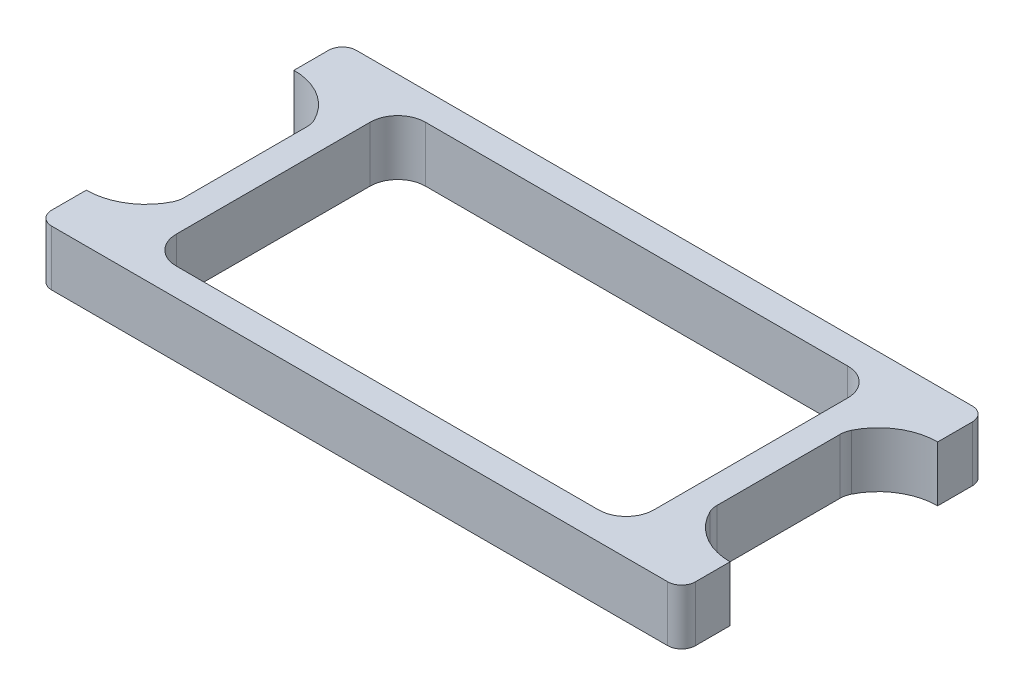
ISO-10303-21;
HEADER;
FILE_DESCRIPTION(('STEP AP214'),'2;1');
FILE_NAME('part.step','',(''),(''),'','','');
FILE_SCHEMA(('AUTOMOTIVE_DESIGN { 1 0 10303 214 1 1 1 1 }'));
ENDSEC;
DATA;
#1=APPLICATION_CONTEXT('core data for automotive mechanical design processes');
#2=APPLICATION_PROTOCOL_DEFINITION('international standard','automotive_design',2000,#1);
#3=PRODUCT_CONTEXT('',#1,'mechanical');
#4=PRODUCT('Part','Part','',(#3));
#5=PRODUCT_RELATED_PRODUCT_CATEGORY('part','',(#4));
#6=PRODUCT_DEFINITION_FORMATION('','',#4);
#7=PRODUCT_DEFINITION_CONTEXT('part definition',#1,'design');
#8=PRODUCT_DEFINITION('design','',#6,#7);
#9=PRODUCT_DEFINITION_SHAPE('','',#8);
#10=(LENGTH_UNIT() NAMED_UNIT(*) SI_UNIT(.MILLI.,.METRE.));
#11=(NAMED_UNIT(*) PLANE_ANGLE_UNIT() SI_UNIT($,.RADIAN.));
#12=(NAMED_UNIT(*) SI_UNIT($,.STERADIAN.) SOLID_ANGLE_UNIT());
#13=UNCERTAINTY_MEASURE_WITH_UNIT(LENGTH_MEASURE(1.E-05),#10,'distance_accuracy_value','');
#14=(GEOMETRIC_REPRESENTATION_CONTEXT(3) GLOBAL_UNCERTAINTY_ASSIGNED_CONTEXT((#13)) GLOBAL_UNIT_ASSIGNED_CONTEXT((#10,
#11,#12)) REPRESENTATION_CONTEXT('',''));
#15=CARTESIAN_POINT('',(0.,0.,0.));
#16=DIRECTION('',(0.,0.,1.));
#17=DIRECTION('',(1.,0.,0.));
#18=AXIS2_PLACEMENT_3D('',#15,#16,#17);
#19=CARTESIAN_POINT('',(46.5,8.,22.));
#20=DIRECTION('',(-1.,0.,0.));
#21=DIRECTION('',(0.,0.,1.));
#22=AXIS2_PLACEMENT_3D('',#19,#20,#21);
#23=PLANE('',#22);
#24=DIRECTION('',(0.,1.,0.));
#25=VECTOR('',#24,1.);
#26=CARTESIAN_POINT('',(46.5,0.,-15.));
#27=LINE('',#26,#25);
#28=CARTESIAN_POINT('',(46.5,0.,-15.));
#29=VERTEX_POINT('',#28);
#30=CARTESIAN_POINT('',(46.5,8.,-15.));
#31=VERTEX_POINT('',#30);
#32=EDGE_CURVE('E236',#29,#31,#27,.T.);
#33=ORIENTED_EDGE('',*,*,#32,.F.);
#34=DIRECTION('',(0.,0.,-1.));
#35=VECTOR('',#34,1.);
#36=CARTESIAN_POINT('',(46.5,0.,22.));
#37=LINE('',#36,#35);
#38=CARTESIAN_POINT('',(46.5,0.,-20.));
#39=VERTEX_POINT('',#38);
#40=EDGE_CURVE('E252',#29,#39,#37,.T.);
#41=ORIENTED_EDGE('',*,*,#40,.T.);
#42=DIRECTION('',(0.,-1.,0.));
#43=VECTOR('',#42,1.);
#44=CARTESIAN_POINT('',(46.5,8.,-20.));
#45=LINE('',#44,#43);
#46=CARTESIAN_POINT('',(46.5,8.,-20.));
#47=VERTEX_POINT('',#46);
#48=EDGE_CURVE('E328',#39,#47,#45,.F.);
#49=ORIENTED_EDGE('',*,*,#48,.T.);
#50=DIRECTION('',(0.,0.,-1.));
#51=VECTOR('',#50,1.);
#52=CARTESIAN_POINT('',(46.5,8.,22.));
#53=LINE('',#52,#51);
#54=EDGE_CURVE('E515',#31,#47,#53,.T.);
#55=ORIENTED_EDGE('',*,*,#54,.F.);
#56=EDGE_LOOP('',(#33,#41,#49,#55));
#57=FACE_BOUND('',#56,.T.);
#58=ADVANCED_FACE('F41',(#57),#23,.F.);
#59=DIRECTION('',(0.,1.,0.));
#60=VECTOR('',#59,1.);
#61=CARTESIAN_POINT('',(46.5,0.,15.));
#62=LINE('',#61,#60);
#63=CARTESIAN_POINT('',(46.5,0.,15.));
#64=VERTEX_POINT('',#63);
#65=CARTESIAN_POINT('',(46.5,8.,15.));
#66=VERTEX_POINT('',#65);
#67=EDGE_CURVE('E224',#64,#66,#62,.T.);
#68=ORIENTED_EDGE('',*,*,#67,.T.);
#69=CARTESIAN_POINT('',(46.5,8.,20.));
#70=VERTEX_POINT('',#69);
#71=EDGE_CURVE('E516',#70,#66,#53,.T.);
#72=ORIENTED_EDGE('',*,*,#71,.F.);
#73=DIRECTION('',(0.,-1.,0.));
#74=VECTOR('',#73,1.);
#75=CARTESIAN_POINT('',(46.5,8.,20.));
#76=LINE('',#75,#74);
#77=CARTESIAN_POINT('',(46.5,0.,20.));
#78=VERTEX_POINT('',#77);
#79=EDGE_CURVE('E250',#70,#78,#76,.T.);
#80=ORIENTED_EDGE('',*,*,#79,.T.);
#81=EDGE_CURVE('E241',#78,#64,#37,.T.);
#82=ORIENTED_EDGE('',*,*,#81,.T.);
#83=EDGE_LOOP('',(#68,#72,#80,#82));
#84=FACE_BOUND('',#83,.T.);
#85=ADVANCED_FACE('F248',(#84),#23,.F.);
#86=CARTESIAN_POINT('',(0.,8.,0.));
#87=DIRECTION('',(0.,1.,0.));
#88=DIRECTION('',(0.,0.,1.));
#89=AXIS2_PLACEMENT_3D('',#86,#87,#88);
#90=PLANE('',#89);
#91=DIRECTION('',(1.,0.,0.));
#92=VECTOR('',#91,1.);
#93=CARTESIAN_POINT('',(-34.5,8.,18.));
#94=LINE('',#93,#92);
#95=CARTESIAN_POINT('',(-30.5,8.,18.));
#96=VERTEX_POINT('',#95);
#97=CARTESIAN_POINT('',(30.5,8.,18.));
#98=VERTEX_POINT('',#97);
#99=EDGE_CURVE('E346',#96,#98,#94,.T.);
#100=ORIENTED_EDGE('',*,*,#99,.F.);
#101=CARTESIAN_POINT('',(-30.5,8.,14.));
#102=DIRECTION('',(0.,1.,0.));
#103=DIRECTION('',(0.,0.,1.));
#104=AXIS2_PLACEMENT_3D('',#101,#102,#103);
#105=CIRCLE('',#104,4.);
#106=CARTESIAN_POINT('',(-34.5,8.,14.));
#107=VERTEX_POINT('',#106);
#108=EDGE_CURVE('E290',#96,#107,#105,.F.);
#109=ORIENTED_EDGE('',*,*,#108,.T.);
#110=DIRECTION('',(0.,0.,1.));
#111=VECTOR('',#110,1.);
#112=CARTESIAN_POINT('',(-34.5,8.,-18.));
#113=LINE('',#112,#111);
#114=CARTESIAN_POINT('',(-34.5,8.,-14.));
#115=VERTEX_POINT('',#114);
#116=EDGE_CURVE('E490',#115,#107,#113,.T.);
#117=ORIENTED_EDGE('',*,*,#116,.F.);
#118=CARTESIAN_POINT('',(-30.5,8.,-14.));
#119=DIRECTION('',(0.,1.,0.));
#120=DIRECTION('',(0.,0.,1.));
#121=AXIS2_PLACEMENT_3D('',#118,#119,#120);
#122=CIRCLE('',#121,4.);
#123=CARTESIAN_POINT('',(-30.5,8.,-18.));
#124=VERTEX_POINT('',#123);
#125=EDGE_CURVE('E294',#115,#124,#122,.F.);
#126=ORIENTED_EDGE('',*,*,#125,.T.);
#127=DIRECTION('',(-1.,0.,0.));
#128=VECTOR('',#127,1.);
#129=CARTESIAN_POINT('',(34.5,8.,-18.));
#130=LINE('',#129,#128);
#131=CARTESIAN_POINT('',(30.5,8.,-18.));
#132=VERTEX_POINT('',#131);
#133=EDGE_CURVE('E505',#132,#124,#130,.T.);
#134=ORIENTED_EDGE('',*,*,#133,.F.);
#135=CARTESIAN_POINT('',(30.5,8.,-14.));
#136=DIRECTION('',(0.,1.,0.));
#137=DIRECTION('',(0.,0.,1.));
#138=AXIS2_PLACEMENT_3D('',#135,#136,#137);
#139=CIRCLE('',#138,4.);
#140=CARTESIAN_POINT('',(34.5,8.,-14.));
#141=VERTEX_POINT('',#140);
#142=EDGE_CURVE('E282',#132,#141,#139,.F.);
#143=ORIENTED_EDGE('',*,*,#142,.T.);
#144=DIRECTION('',(0.,0.,-1.));
#145=VECTOR('',#144,1.);
#146=CARTESIAN_POINT('',(34.5,8.,18.));
#147=LINE('',#146,#145);
#148=CARTESIAN_POINT('',(34.5,8.,14.));
#149=VERTEX_POINT('',#148);
#150=EDGE_CURVE('E502',#149,#141,#147,.T.);
#151=ORIENTED_EDGE('',*,*,#150,.F.);
#152=CARTESIAN_POINT('',(30.5,8.,14.));
#153=DIRECTION('',(0.,1.,0.));
#154=DIRECTION('',(0.,0.,1.));
#155=AXIS2_PLACEMENT_3D('',#152,#153,#154);
#156=CIRCLE('',#155,4.);
#157=EDGE_CURVE('E286',#149,#98,#156,.F.);
#158=ORIENTED_EDGE('',*,*,#157,.T.);
#159=EDGE_LOOP('',(#100,#109,#117,#126,#134,#143,#151,#158));
#160=FACE_BOUND('',#159,.T.);
#161=CARTESIAN_POINT('',(46.5,8.,6.41920896797299));
#162=DIRECTION('',(0.,1.,0.));
#163=DIRECTION('',(0.,0.,1.));
#164=AXIS2_PLACEMENT_3D('',#161,#162,#163);
#165=CIRCLE('',#164,8.58079103202701);
#166=CARTESIAN_POINT('',(38.8122089836516,8.,10.2307498669098));
#167=VERTEX_POINT('',#166);
#168=EDGE_CURVE('E231',#66,#167,#165,.F.);
#169=ORIENTED_EDGE('',*,*,#168,.T.);
#170=CARTESIAN_POINT('',(41.5,8.,8.89816611628216));
#171=DIRECTION('',(0.,1.,0.));
#172=DIRECTION('',(0.,0.,1.));
#173=AXIS2_PLACEMENT_3D('',#170,#171,#172);
#174=CIRCLE('',#173,3.);
#175=CARTESIAN_POINT('',(38.5,8.,8.89816611628216));
#176=VERTEX_POINT('',#175);
#177=EDGE_CURVE('E378',#167,#176,#174,.F.);
#178=ORIENTED_EDGE('',*,*,#177,.T.);
#179=DIRECTION('',(0.,0.,1.));
#180=VECTOR('',#179,1.);
#181=CARTESIAN_POINT('',(38.5,8.,0.));
#182=LINE('',#181,#180);
#183=CARTESIAN_POINT('',(38.5,8.,-8.89816611628216));
#184=VERTEX_POINT('',#183);
#185=EDGE_CURVE('E365',#176,#184,#182,.F.);
#186=ORIENTED_EDGE('',*,*,#185,.T.);
#187=CARTESIAN_POINT('',(41.5,8.,-8.89816611628216));
#188=DIRECTION('',(0.,1.,0.));
#189=DIRECTION('',(0.,0.,1.));
#190=AXIS2_PLACEMENT_3D('',#187,#188,#189);
#191=CIRCLE('',#190,3.);
#192=CARTESIAN_POINT('',(38.8122089836516,8.,-10.2307498669098));
#193=VERTEX_POINT('',#192);
#194=EDGE_CURVE('E49',#184,#193,#191,.F.);
#195=ORIENTED_EDGE('',*,*,#194,.T.);
#196=CARTESIAN_POINT('',(46.5,8.,-6.41920896797299));
#197=DIRECTION('',(0.,1.,0.));
#198=DIRECTION('',(0.,0.,1.));
#199=AXIS2_PLACEMENT_3D('',#196,#197,#198);
#200=CIRCLE('',#199,8.58079103202701);
#201=EDGE_CURVE('E368',#193,#31,#200,.F.);
#202=ORIENTED_EDGE('',*,*,#201,.T.);
#203=ORIENTED_EDGE('',*,*,#54,.T.);
#204=CARTESIAN_POINT('',(44.5,8.,-20.));
#205=DIRECTION('',(0.,1.,0.));
#206=DIRECTION('',(0.,0.,1.));
#207=AXIS2_PLACEMENT_3D('',#204,#205,#206);
#208=CIRCLE('',#207,2.);
#209=CARTESIAN_POINT('',(44.5,8.,-22.));
#210=VERTEX_POINT('',#209);
#211=EDGE_CURVE('E323',#47,#210,#208,.T.);
#212=ORIENTED_EDGE('',*,*,#211,.T.);
#213=DIRECTION('',(-1.,0.,0.));
#214=VECTOR('',#213,1.);
#215=CARTESIAN_POINT('',(46.5,8.,-22.));
#216=LINE('',#215,#214);
#217=CARTESIAN_POINT('',(-44.5,8.,-22.));
#218=VERTEX_POINT('',#217);
#219=EDGE_CURVE('E264',#210,#218,#216,.T.);
#220=ORIENTED_EDGE('',*,*,#219,.T.);
#221=CARTESIAN_POINT('',(-44.5,8.,-20.));
#222=DIRECTION('',(0.,1.,0.));
#223=DIRECTION('',(0.,0.,1.));
#224=AXIS2_PLACEMENT_3D('',#221,#222,#223);
#225=CIRCLE('',#224,2.);
#226=CARTESIAN_POINT('',(-46.5,8.,-20.));
#227=VERTEX_POINT('',#226);
#228=EDGE_CURVE('E325',#218,#227,#225,.T.);
#229=ORIENTED_EDGE('',*,*,#228,.T.);
#230=DIRECTION('',(0.,0.,1.));
#231=VECTOR('',#230,1.);
#232=CARTESIAN_POINT('',(-46.5,8.,22.));
#233=LINE('',#232,#231);
#234=CARTESIAN_POINT('',(-46.5,8.,-15.));
#235=VERTEX_POINT('',#234);
#236=EDGE_CURVE('E511',#227,#235,#233,.T.);
#237=ORIENTED_EDGE('',*,*,#236,.T.);
#238=CARTESIAN_POINT('',(-46.5,8.,-6.41920896797299));
#239=DIRECTION('',(0.,1.,0.));
#240=DIRECTION('',(0.,0.,1.));
#241=AXIS2_PLACEMENT_3D('',#238,#239,#240);
#242=CIRCLE('',#241,8.58079103202701);
#243=CARTESIAN_POINT('',(-38.8122089836516,8.,-10.2307498669098));
#244=VERTEX_POINT('',#243);
#245=EDGE_CURVE('E344',#244,#235,#242,.T.);
#246=ORIENTED_EDGE('',*,*,#245,.F.);
#247=CARTESIAN_POINT('',(-41.5,8.,-8.89816611628216));
#248=DIRECTION('',(0.,1.,0.));
#249=DIRECTION('',(0.,0.,1.));
#250=AXIS2_PLACEMENT_3D('',#247,#248,#249);
#251=CIRCLE('',#250,3.);
#252=CARTESIAN_POINT('',(-38.5,8.,-8.89816611628216));
#253=VERTEX_POINT('',#252);
#254=EDGE_CURVE('E360',#244,#253,#251,.F.);
#255=ORIENTED_EDGE('',*,*,#254,.T.);
#256=DIRECTION('',(0.,0.,-1.));
#257=VECTOR('',#256,1.);
#258=CARTESIAN_POINT('',(-38.5,8.,-9.52242902709144));
#259=LINE('',#258,#257);
#260=CARTESIAN_POINT('',(-38.5,8.,8.89816611628216));
#261=VERTEX_POINT('',#260);
#262=EDGE_CURVE('E340',#261,#253,#259,.T.);
#263=ORIENTED_EDGE('',*,*,#262,.F.);
#264=CARTESIAN_POINT('',(-41.5,8.,8.89816611628216));
#265=DIRECTION('',(0.,1.,0.));
#266=DIRECTION('',(0.,0.,1.));
#267=AXIS2_PLACEMENT_3D('',#264,#265,#266);
#268=CIRCLE('',#267,3.);
#269=CARTESIAN_POINT('',(-38.8122089836516,8.,10.2307498669098));
#270=VERTEX_POINT('',#269);
#271=EDGE_CURVE('E356',#261,#270,#268,.F.);
#272=ORIENTED_EDGE('',*,*,#271,.T.);
#273=CARTESIAN_POINT('',(-46.5,8.,6.41920896797299));
#274=DIRECTION('',(0.,1.,0.));
#275=DIRECTION('',(0.,0.,1.));
#276=AXIS2_PLACEMENT_3D('',#273,#274,#275);
#277=CIRCLE('',#276,8.58079103202701);
#278=CARTESIAN_POINT('',(-46.5,8.,15.));
#279=VERTEX_POINT('',#278);
#280=EDGE_CURVE('E337',#279,#270,#277,.T.);
#281=ORIENTED_EDGE('',*,*,#280,.F.);
#282=CARTESIAN_POINT('',(-46.5,8.,20.));
#283=VERTEX_POINT('',#282);
#284=EDGE_CURVE('E255',#279,#283,#233,.T.);
#285=ORIENTED_EDGE('',*,*,#284,.T.);
#286=CARTESIAN_POINT('',(-44.5,8.,20.));
#287=DIRECTION('',(0.,1.,0.));
#288=DIRECTION('',(0.,0.,1.));
#289=AXIS2_PLACEMENT_3D('',#286,#287,#288);
#290=CIRCLE('',#289,2.);
#291=CARTESIAN_POINT('',(-44.5,8.,22.));
#292=VERTEX_POINT('',#291);
#293=EDGE_CURVE('E321',#283,#292,#290,.T.);
#294=ORIENTED_EDGE('',*,*,#293,.T.);
#295=DIRECTION('',(1.,0.,0.));
#296=VECTOR('',#295,1.);
#297=CARTESIAN_POINT('',(46.5,8.,22.));
#298=LINE('',#297,#296);
#299=CARTESIAN_POINT('',(44.5,8.,22.));
#300=VERTEX_POINT('',#299);
#301=EDGE_CURVE('E512',#292,#300,#298,.T.);
#302=ORIENTED_EDGE('',*,*,#301,.T.);
#303=CARTESIAN_POINT('',(44.5,8.,20.));
#304=DIRECTION('',(0.,1.,0.));
#305=DIRECTION('',(0.,0.,1.));
#306=AXIS2_PLACEMENT_3D('',#303,#304,#305);
#307=CIRCLE('',#306,2.);
#308=EDGE_CURVE('E319',#300,#70,#307,.T.);
#309=ORIENTED_EDGE('',*,*,#308,.T.);
#310=ORIENTED_EDGE('',*,*,#71,.T.);
#311=EDGE_LOOP('',(#169,#178,#186,#195,#202,#203,#212,#220,#229,#237,#246,#255,#263,#272,#281,
#285,#294,#302,#309,#310));
#312=FACE_BOUND('',#311,.T.);
#313=ADVANCED_FACE('F381',(#160,#312),#90,.T.);
#314=CARTESIAN_POINT('',(0.,0.,0.));
#315=DIRECTION('',(0.,1.,0.));
#316=DIRECTION('',(0.,0.,1.));
#317=AXIS2_PLACEMENT_3D('',#314,#315,#316);
#318=PLANE('',#317);
#319=DIRECTION('',(-1.,0.,0.));
#320=VECTOR('',#319,1.);
#321=CARTESIAN_POINT('',(34.5,0.,-18.));
#322=LINE('',#321,#320);
#323=CARTESIAN_POINT('',(30.5,0.,-18.));
#324=VERTEX_POINT('',#323);
#325=CARTESIAN_POINT('',(-30.5,0.,-18.));
#326=VERTEX_POINT('',#325);
#327=EDGE_CURVE('E493',#324,#326,#322,.T.);
#328=ORIENTED_EDGE('',*,*,#327,.T.);
#329=CARTESIAN_POINT('',(-30.5,0.,-14.));
#330=DIRECTION('',(0.,1.,0.));
#331=DIRECTION('',(0.,0.,1.));
#332=AXIS2_PLACEMENT_3D('',#329,#330,#331);
#333=CIRCLE('',#332,4.);
#334=CARTESIAN_POINT('',(-34.5,0.,-14.));
#335=VERTEX_POINT('',#334);
#336=EDGE_CURVE('E296',#326,#335,#333,.T.);
#337=ORIENTED_EDGE('',*,*,#336,.T.);
#338=DIRECTION('',(0.,0.,1.));
#339=VECTOR('',#338,1.);
#340=CARTESIAN_POINT('',(-34.5,0.,-18.));
#341=LINE('',#340,#339);
#342=CARTESIAN_POINT('',(-34.5,0.,14.));
#343=VERTEX_POINT('',#342);
#344=EDGE_CURVE('E496',#335,#343,#341,.T.);
#345=ORIENTED_EDGE('',*,*,#344,.T.);
#346=CARTESIAN_POINT('',(-30.5,0.,14.));
#347=DIRECTION('',(0.,1.,0.));
#348=DIRECTION('',(0.,0.,1.));
#349=AXIS2_PLACEMENT_3D('',#346,#347,#348);
#350=CIRCLE('',#349,4.);
#351=CARTESIAN_POINT('',(-30.5,0.,18.));
#352=VERTEX_POINT('',#351);
#353=EDGE_CURVE('E292',#343,#352,#350,.T.);
#354=ORIENTED_EDGE('',*,*,#353,.T.);
#355=DIRECTION('',(1.,0.,0.));
#356=VECTOR('',#355,1.);
#357=CARTESIAN_POINT('',(-34.5,0.,18.));
#358=LINE('',#357,#356);
#359=CARTESIAN_POINT('',(30.5,0.,18.));
#360=VERTEX_POINT('',#359);
#361=EDGE_CURVE('E486',#352,#360,#358,.T.);
#362=ORIENTED_EDGE('',*,*,#361,.T.);
#363=CARTESIAN_POINT('',(30.5,0.,14.));
#364=DIRECTION('',(0.,1.,0.));
#365=DIRECTION('',(0.,0.,1.));
#366=AXIS2_PLACEMENT_3D('',#363,#364,#365);
#367=CIRCLE('',#366,4.);
#368=CARTESIAN_POINT('',(34.5,0.,14.));
#369=VERTEX_POINT('',#368);
#370=EDGE_CURVE('E288',#360,#369,#367,.T.);
#371=ORIENTED_EDGE('',*,*,#370,.T.);
#372=DIRECTION('',(0.,0.,-1.));
#373=VECTOR('',#372,1.);
#374=CARTESIAN_POINT('',(34.5,0.,18.));
#375=LINE('',#374,#373);
#376=CARTESIAN_POINT('',(34.5,0.,-14.));
#377=VERTEX_POINT('',#376);
#378=EDGE_CURVE('E489',#369,#377,#375,.T.);
#379=ORIENTED_EDGE('',*,*,#378,.T.);
#380=CARTESIAN_POINT('',(30.5,0.,-14.));
#381=DIRECTION('',(0.,1.,0.));
#382=DIRECTION('',(0.,0.,1.));
#383=AXIS2_PLACEMENT_3D('',#380,#381,#382);
#384=CIRCLE('',#383,4.);
#385=EDGE_CURVE('E284',#377,#324,#384,.T.);
#386=ORIENTED_EDGE('',*,*,#385,.T.);
#387=EDGE_LOOP('',(#328,#337,#345,#354,#362,#371,#379,#386));
#388=FACE_BOUND('',#387,.T.);
#389=CARTESIAN_POINT('',(46.5,0.,-6.41920896797299));
#390=DIRECTION('',(0.,-1.,0.));
#391=DIRECTION('',(0.,0.,-1.));
#392=AXIS2_PLACEMENT_3D('',#389,#390,#391);
#393=CIRCLE('',#392,8.58079103202701);
#394=CARTESIAN_POINT('',(38.8122089836516,0.,-10.2307498669098));
#395=VERTEX_POINT('',#394);
#396=EDGE_CURVE('E552',#395,#29,#393,.T.);
#397=ORIENTED_EDGE('',*,*,#396,.F.);
#398=CARTESIAN_POINT('',(41.5,0.,-8.89816611628216));
#399=DIRECTION('',(0.,1.,0.));
#400=DIRECTION('',(0.,0.,1.));
#401=AXIS2_PLACEMENT_3D('',#398,#399,#400);
#402=CIRCLE('',#401,3.);
#403=CARTESIAN_POINT('',(38.5,0.,-8.89816611628216));
#404=VERTEX_POINT('',#403);
#405=EDGE_CURVE('E11',#395,#404,#402,.T.);
#406=ORIENTED_EDGE('',*,*,#405,.T.);
#407=DIRECTION('',(0.,0.,-1.));
#408=VECTOR('',#407,1.);
#409=CARTESIAN_POINT('',(38.5,0.,-9.52242902709144));
#410=LINE('',#409,#408);
#411=CARTESIAN_POINT('',(38.5,0.,8.89816611628216));
#412=VERTEX_POINT('',#411);
#413=EDGE_CURVE('E245',#412,#404,#410,.T.);
#414=ORIENTED_EDGE('',*,*,#413,.F.);
#415=CARTESIAN_POINT('',(41.5,0.,8.89816611628216));
#416=DIRECTION('',(0.,1.,0.));
#417=DIRECTION('',(0.,0.,1.));
#418=AXIS2_PLACEMENT_3D('',#415,#416,#417);
#419=CIRCLE('',#418,3.);
#420=CARTESIAN_POINT('',(38.8122089836516,0.,10.2307498669098));
#421=VERTEX_POINT('',#420);
#422=EDGE_CURVE('E244',#412,#421,#419,.T.);
#423=ORIENTED_EDGE('',*,*,#422,.T.);
#424=CARTESIAN_POINT('',(46.5,0.,6.41920896797299));
#425=DIRECTION('',(0.,-1.,0.));
#426=DIRECTION('',(0.,0.,1.));
#427=AXIS2_PLACEMENT_3D('',#424,#425,#426);
#428=CIRCLE('',#427,8.58079103202701);
#429=EDGE_CURVE('E228',#64,#421,#428,.T.);
#430=ORIENTED_EDGE('',*,*,#429,.F.);
#431=ORIENTED_EDGE('',*,*,#81,.F.);
#432=CARTESIAN_POINT('',(44.5,0.,20.));
#433=DIRECTION('',(0.,1.,0.));
#434=DIRECTION('',(0.,0.,1.));
#435=AXIS2_PLACEMENT_3D('',#432,#433,#434);
#436=CIRCLE('',#435,2.);
#437=CARTESIAN_POINT('',(44.5,0.,22.));
#438=VERTEX_POINT('',#437);
#439=EDGE_CURVE('E304',#78,#438,#436,.F.);
#440=ORIENTED_EDGE('',*,*,#439,.T.);
#441=DIRECTION('',(1.,0.,0.));
#442=VECTOR('',#441,1.);
#443=CARTESIAN_POINT('',(46.5,0.,22.));
#444=LINE('',#443,#442);
#445=CARTESIAN_POINT('',(-44.5,0.,22.));
#446=VERTEX_POINT('',#445);
#447=EDGE_CURVE('E257',#446,#438,#444,.T.);
#448=ORIENTED_EDGE('',*,*,#447,.F.);
#449=CARTESIAN_POINT('',(-44.5,0.,20.));
#450=DIRECTION('',(0.,1.,0.));
#451=DIRECTION('',(0.,0.,1.));
#452=AXIS2_PLACEMENT_3D('',#449,#450,#451);
#453=CIRCLE('',#452,2.);
#454=CARTESIAN_POINT('',(-46.5,0.,20.));
#455=VERTEX_POINT('',#454);
#456=EDGE_CURVE('E306',#446,#455,#453,.F.);
#457=ORIENTED_EDGE('',*,*,#456,.T.);
#458=DIRECTION('',(0.,0.,1.));
#459=VECTOR('',#458,1.);
#460=CARTESIAN_POINT('',(-46.5,0.,22.));
#461=LINE('',#460,#459);
#462=CARTESIAN_POINT('',(-46.5,0.,15.));
#463=VERTEX_POINT('',#462);
#464=EDGE_CURVE('E499',#463,#455,#461,.T.);
#465=ORIENTED_EDGE('',*,*,#464,.F.);
#466=CARTESIAN_POINT('',(-46.5,0.,6.41920896797299));
#467=DIRECTION('',(0.,1.,0.));
#468=DIRECTION('',(0.,0.,1.));
#469=AXIS2_PLACEMENT_3D('',#466,#467,#468);
#470=CIRCLE('',#469,8.58079103202701);
#471=CARTESIAN_POINT('',(-38.8122089836516,0.,10.2307498669098));
#472=VERTEX_POINT('',#471);
#473=EDGE_CURVE('E477',#463,#472,#470,.T.);
#474=ORIENTED_EDGE('',*,*,#473,.T.);
#475=CARTESIAN_POINT('',(-41.5,0.,8.89816611628216));
#476=DIRECTION('',(0.,1.,0.));
#477=DIRECTION('',(0.,0.,1.));
#478=AXIS2_PLACEMENT_3D('',#475,#476,#477);
#479=CIRCLE('',#478,3.);
#480=CARTESIAN_POINT('',(-38.5,0.,8.89816611628216));
#481=VERTEX_POINT('',#480);
#482=EDGE_CURVE('E358',#472,#481,#479,.T.);
#483=ORIENTED_EDGE('',*,*,#482,.T.);
#484=DIRECTION('',(0.,0.,-1.));
#485=VECTOR('',#484,1.);
#486=CARTESIAN_POINT('',(-38.5,0.,-9.52242902709144));
#487=LINE('',#486,#485);
#488=CARTESIAN_POINT('',(-38.5,0.,-8.89816611628216));
#489=VERTEX_POINT('',#488);
#490=EDGE_CURVE('E471',#481,#489,#487,.T.);
#491=ORIENTED_EDGE('',*,*,#490,.T.);
#492=CARTESIAN_POINT('',(-41.5,0.,-8.89816611628216));
#493=DIRECTION('',(0.,1.,0.));
#494=DIRECTION('',(0.,0.,1.));
#495=AXIS2_PLACEMENT_3D('',#492,#493,#494);
#496=CIRCLE('',#495,3.);
#497=CARTESIAN_POINT('',(-38.8122089836516,0.,-10.2307498669098));
#498=VERTEX_POINT('',#497);
#499=EDGE_CURVE('E362',#489,#498,#496,.T.);
#500=ORIENTED_EDGE('',*,*,#499,.T.);
#501=CARTESIAN_POINT('',(-46.5,0.,-6.41920896797299));
#502=DIRECTION('',(0.,1.,0.));
#503=DIRECTION('',(0.,0.,-1.));
#504=AXIS2_PLACEMENT_3D('',#501,#502,#503);
#505=CIRCLE('',#504,8.58079103202701);
#506=CARTESIAN_POINT('',(-46.5,0.,-15.));
#507=VERTEX_POINT('',#506);
#508=EDGE_CURVE('E370',#498,#507,#505,.T.);
#509=ORIENTED_EDGE('',*,*,#508,.T.);
#510=CARTESIAN_POINT('',(-46.5,0.,-20.));
#511=VERTEX_POINT('',#510);
#512=EDGE_CURVE('E519',#511,#507,#461,.T.);
#513=ORIENTED_EDGE('',*,*,#512,.F.);
#514=CARTESIAN_POINT('',(-44.5,0.,-20.));
#515=DIRECTION('',(0.,1.,0.));
#516=DIRECTION('',(0.,0.,1.));
#517=AXIS2_PLACEMENT_3D('',#514,#515,#516);
#518=CIRCLE('',#517,2.);
#519=CARTESIAN_POINT('',(-44.5,0.,-22.));
#520=VERTEX_POINT('',#519);
#521=EDGE_CURVE('E312',#511,#520,#518,.F.);
#522=ORIENTED_EDGE('',*,*,#521,.T.);
#523=DIRECTION('',(-1.,0.,0.));
#524=VECTOR('',#523,1.);
#525=CARTESIAN_POINT('',(46.5,0.,-22.));
#526=LINE('',#525,#524);
#527=CARTESIAN_POINT('',(44.5,0.,-22.));
#528=VERTEX_POINT('',#527);
#529=EDGE_CURVE('E251',#528,#520,#526,.T.);
#530=ORIENTED_EDGE('',*,*,#529,.F.);
#531=CARTESIAN_POINT('',(44.5,0.,-20.));
#532=DIRECTION('',(0.,1.,0.));
#533=DIRECTION('',(0.,0.,1.));
#534=AXIS2_PLACEMENT_3D('',#531,#532,#533);
#535=CIRCLE('',#534,2.);
#536=EDGE_CURVE('E309',#528,#39,#535,.F.);
#537=ORIENTED_EDGE('',*,*,#536,.T.);
#538=ORIENTED_EDGE('',*,*,#40,.F.);
#539=EDGE_LOOP('',(#397,#406,#414,#423,#430,#431,#440,#448,#457,#465,#474,#483,#491,#500,#509,
#513,#522,#530,#537,#538));
#540=FACE_BOUND('',#539,.T.);
#541=ADVANCED_FACE('F240',(#388,#540),#318,.F.);
#542=CARTESIAN_POINT('',(-46.5,8.,22.));
#543=DIRECTION('',(1.,0.,0.));
#544=DIRECTION('',(0.,0.,-1.));
#545=AXIS2_PLACEMENT_3D('',#542,#543,#544);
#546=PLANE('',#545);
#547=ORIENTED_EDGE('',*,*,#512,.T.);
#548=DIRECTION('',(0.,1.,0.));
#549=VECTOR('',#548,1.);
#550=CARTESIAN_POINT('',(-46.5,0.,-15.));
#551=LINE('',#550,#549);
#552=EDGE_CURVE('E475',#507,#235,#551,.T.);
#553=ORIENTED_EDGE('',*,*,#552,.T.);
#554=ORIENTED_EDGE('',*,*,#236,.F.);
#555=DIRECTION('',(0.,-1.,0.));
#556=VECTOR('',#555,1.);
#557=CARTESIAN_POINT('',(-46.5,8.,-20.));
#558=LINE('',#557,#556);
#559=EDGE_CURVE('E301',#227,#511,#558,.T.);
#560=ORIENTED_EDGE('',*,*,#559,.T.);
#561=EDGE_LOOP('',(#547,#553,#554,#560));
#562=FACE_BOUND('',#561,.T.);
#563=ADVANCED_FACE('F416',(#562),#546,.F.);
#564=ORIENTED_EDGE('',*,*,#284,.F.);
#565=DIRECTION('',(0.,1.,0.));
#566=VECTOR('',#565,1.);
#567=CARTESIAN_POINT('',(-46.5,0.,15.));
#568=LINE('',#567,#566);
#569=EDGE_CURVE('E341',#463,#279,#568,.T.);
#570=ORIENTED_EDGE('',*,*,#569,.F.);
#571=ORIENTED_EDGE('',*,*,#464,.T.);
#572=DIRECTION('',(0.,-1.,0.));
#573=VECTOR('',#572,1.);
#574=CARTESIAN_POINT('',(-46.5,8.,20.));
#575=LINE('',#574,#573);
#576=EDGE_CURVE('E298',#455,#283,#575,.F.);
#577=ORIENTED_EDGE('',*,*,#576,.T.);
#578=EDGE_LOOP('',(#564,#570,#571,#577));
#579=FACE_BOUND('',#578,.T.);
#580=ADVANCED_FACE('F412',(#579),#546,.F.);
#581=CARTESIAN_POINT('',(46.5,8.,22.));
#582=DIRECTION('',(0.,0.,-1.));
#583=DIRECTION('',(-1.,0.,0.));
#584=AXIS2_PLACEMENT_3D('',#581,#582,#583);
#585=PLANE('',#584);
#586=ORIENTED_EDGE('',*,*,#301,.F.);
#587=DIRECTION('',(0.,-1.,0.));
#588=VECTOR('',#587,1.);
#589=CARTESIAN_POINT('',(-44.5,8.,22.));
#590=LINE('',#589,#588);
#591=EDGE_CURVE('E333',#292,#446,#590,.T.);
#592=ORIENTED_EDGE('',*,*,#591,.T.);
#593=ORIENTED_EDGE('',*,*,#447,.T.);
#594=DIRECTION('',(0.,-1.,0.));
#595=VECTOR('',#594,1.);
#596=CARTESIAN_POINT('',(44.5,8.,22.));
#597=LINE('',#596,#595);
#598=EDGE_CURVE('E331',#438,#300,#597,.F.);
#599=ORIENTED_EDGE('',*,*,#598,.T.);
#600=EDGE_LOOP('',(#586,#592,#593,#599));
#601=FACE_BOUND('',#600,.T.);
#602=ADVANCED_FACE('F409',(#601),#585,.F.);
#603=CARTESIAN_POINT('',(46.5,8.,-22.));
#604=DIRECTION('',(0.,0.,1.));
#605=DIRECTION('',(1.,0.,0.));
#606=AXIS2_PLACEMENT_3D('',#603,#604,#605);
#607=PLANE('',#606);
#608=ORIENTED_EDGE('',*,*,#529,.T.);
#609=DIRECTION('',(0.,-1.,0.));
#610=VECTOR('',#609,1.);
#611=CARTESIAN_POINT('',(-44.5,8.,-22.));
#612=LINE('',#611,#610);
#613=EDGE_CURVE('E317',#520,#218,#612,.F.);
#614=ORIENTED_EDGE('',*,*,#613,.T.);
#615=ORIENTED_EDGE('',*,*,#219,.F.);
#616=DIRECTION('',(0.,-1.,0.));
#617=VECTOR('',#616,1.);
#618=CARTESIAN_POINT('',(44.5,8.,-22.));
#619=LINE('',#618,#617);
#620=EDGE_CURVE('E314',#210,#528,#619,.T.);
#621=ORIENTED_EDGE('',*,*,#620,.T.);
#622=EDGE_LOOP('',(#608,#614,#615,#621));
#623=FACE_BOUND('',#622,.T.);
#624=ADVANCED_FACE('F407',(#623),#607,.F.);
#625=CARTESIAN_POINT('',(-34.5,0.,18.));
#626=DIRECTION('',(0.,0.,1.));
#627=DIRECTION('',(1.,0.,0.));
#628=AXIS2_PLACEMENT_3D('',#625,#626,#627);
#629=PLANE('',#628);
#630=ORIENTED_EDGE('',*,*,#99,.T.);
#631=DIRECTION('',(0.,1.,0.));
#632=VECTOR('',#631,1.);
#633=CARTESIAN_POINT('',(30.5,0.,18.));
#634=LINE('',#633,#632);
#635=EDGE_CURVE('E275',#98,#360,#634,.F.);
#636=ORIENTED_EDGE('',*,*,#635,.T.);
#637=ORIENTED_EDGE('',*,*,#361,.F.);
#638=DIRECTION('',(0.,1.,0.));
#639=VECTOR('',#638,1.);
#640=CARTESIAN_POINT('',(-30.5,8.,18.));
#641=LINE('',#640,#639);
#642=EDGE_CURVE('E272',#352,#96,#641,.T.);
#643=ORIENTED_EDGE('',*,*,#642,.T.);
#644=EDGE_LOOP('',(#630,#636,#637,#643));
#645=FACE_BOUND('',#644,.T.);
#646=ADVANCED_FACE('F559',(#645),#629,.F.);
#647=CARTESIAN_POINT('',(-34.5,0.,-18.));
#648=DIRECTION('',(-1.,0.,0.));
#649=DIRECTION('',(0.,0.,1.));
#650=AXIS2_PLACEMENT_3D('',#647,#648,#649);
#651=PLANE('',#650);
#652=ORIENTED_EDGE('',*,*,#116,.T.);
#653=DIRECTION('',(0.,1.,0.));
#654=VECTOR('',#653,1.);
#655=CARTESIAN_POINT('',(-34.5,0.,14.));
#656=LINE('',#655,#654);
#657=EDGE_CURVE('E280',#107,#343,#656,.F.);
#658=ORIENTED_EDGE('',*,*,#657,.T.);
#659=ORIENTED_EDGE('',*,*,#344,.F.);
#660=DIRECTION('',(0.,1.,0.));
#661=VECTOR('',#660,1.);
#662=CARTESIAN_POINT('',(-34.5,8.,-14.));
#663=LINE('',#662,#661);
#664=EDGE_CURVE('E277',#335,#115,#663,.T.);
#665=ORIENTED_EDGE('',*,*,#664,.T.);
#666=EDGE_LOOP('',(#652,#658,#659,#665));
#667=FACE_BOUND('',#666,.T.);
#668=ADVANCED_FACE('F563',(#667),#651,.F.);
#669=CARTESIAN_POINT('',(34.5,0.,-18.));
#670=DIRECTION('',(0.,0.,-1.));
#671=DIRECTION('',(-1.,0.,0.));
#672=AXIS2_PLACEMENT_3D('',#669,#670,#671);
#673=PLANE('',#672);
#674=ORIENTED_EDGE('',*,*,#327,.F.);
#675=DIRECTION('',(0.,1.,0.));
#676=VECTOR('',#675,1.);
#677=CARTESIAN_POINT('',(30.5,8.,-18.));
#678=LINE('',#677,#676);
#679=EDGE_CURVE('E263',#324,#132,#678,.T.);
#680=ORIENTED_EDGE('',*,*,#679,.T.);
#681=ORIENTED_EDGE('',*,*,#133,.T.);
#682=DIRECTION('',(0.,1.,0.));
#683=VECTOR('',#682,1.);
#684=CARTESIAN_POINT('',(-30.5,0.,-18.));
#685=LINE('',#684,#683);
#686=EDGE_CURVE('E261',#124,#326,#685,.F.);
#687=ORIENTED_EDGE('',*,*,#686,.T.);
#688=EDGE_LOOP('',(#674,#680,#681,#687));
#689=FACE_BOUND('',#688,.T.);
#690=ADVANCED_FACE('F569',(#689),#673,.F.);
#691=CARTESIAN_POINT('',(34.5,0.,18.));
#692=DIRECTION('',(1.,0.,0.));
#693=DIRECTION('',(0.,0.,-1.));
#694=AXIS2_PLACEMENT_3D('',#691,#692,#693);
#695=PLANE('',#694);
#696=ORIENTED_EDGE('',*,*,#150,.T.);
#697=DIRECTION('',(0.,1.,0.));
#698=VECTOR('',#697,1.);
#699=CARTESIAN_POINT('',(34.5,0.,-14.));
#700=LINE('',#699,#698);
#701=EDGE_CURVE('E270',#141,#377,#700,.F.);
#702=ORIENTED_EDGE('',*,*,#701,.T.);
#703=ORIENTED_EDGE('',*,*,#378,.F.);
#704=DIRECTION('',(0.,1.,0.));
#705=VECTOR('',#704,1.);
#706=CARTESIAN_POINT('',(34.5,8.,14.));
#707=LINE('',#706,#705);
#708=EDGE_CURVE('E267',#369,#149,#707,.T.);
#709=ORIENTED_EDGE('',*,*,#708,.T.);
#710=EDGE_LOOP('',(#696,#702,#703,#709));
#711=FACE_BOUND('',#710,.T.);
#712=ADVANCED_FACE('F422',(#711),#695,.F.);
#713=CARTESIAN_POINT('',(30.5,0.,-14.));
#714=DIRECTION('',(0.,-1.,0.));
#715=DIRECTION('',(0.,0.,-1.));
#716=AXIS2_PLACEMENT_3D('',#713,#714,#715);
#717=CYLINDRICAL_SURFACE('',#716,4.);
#718=ORIENTED_EDGE('',*,*,#385,.F.);
#719=ORIENTED_EDGE('',*,*,#701,.F.);
#720=ORIENTED_EDGE('',*,*,#142,.F.);
#721=ORIENTED_EDGE('',*,*,#679,.F.);
#722=EDGE_LOOP('',(#718,#719,#720,#721));
#723=FACE_BOUND('',#722,.T.);
#724=ADVANCED_FACE('F418',(#723),#717,.F.);
#725=CARTESIAN_POINT('',(30.5,0.,14.));
#726=DIRECTION('',(0.,-1.,0.));
#727=DIRECTION('',(0.,0.,-1.));
#728=AXIS2_PLACEMENT_3D('',#725,#726,#727);
#729=CYLINDRICAL_SURFACE('',#728,4.);
#730=ORIENTED_EDGE('',*,*,#370,.F.);
#731=ORIENTED_EDGE('',*,*,#635,.F.);
#732=ORIENTED_EDGE('',*,*,#157,.F.);
#733=ORIENTED_EDGE('',*,*,#708,.F.);
#734=EDGE_LOOP('',(#730,#731,#732,#733));
#735=FACE_BOUND('',#734,.T.);
#736=ADVANCED_FACE('F421',(#735),#729,.F.);
#737=CARTESIAN_POINT('',(-30.5,0.,14.));
#738=DIRECTION('',(0.,-1.,0.));
#739=DIRECTION('',(0.,0.,-1.));
#740=AXIS2_PLACEMENT_3D('',#737,#738,#739);
#741=CYLINDRICAL_SURFACE('',#740,4.);
#742=ORIENTED_EDGE('',*,*,#353,.F.);
#743=ORIENTED_EDGE('',*,*,#657,.F.);
#744=ORIENTED_EDGE('',*,*,#108,.F.);
#745=ORIENTED_EDGE('',*,*,#642,.F.);
#746=EDGE_LOOP('',(#742,#743,#744,#745));
#747=FACE_BOUND('',#746,.T.);
#748=ADVANCED_FACE('F426',(#747),#741,.F.);
#749=CARTESIAN_POINT('',(-30.5,0.,-14.));
#750=DIRECTION('',(0.,-1.,0.));
#751=DIRECTION('',(0.,0.,-1.));
#752=AXIS2_PLACEMENT_3D('',#749,#750,#751);
#753=CYLINDRICAL_SURFACE('',#752,4.);
#754=ORIENTED_EDGE('',*,*,#336,.F.);
#755=ORIENTED_EDGE('',*,*,#686,.F.);
#756=ORIENTED_EDGE('',*,*,#125,.F.);
#757=ORIENTED_EDGE('',*,*,#664,.F.);
#758=EDGE_LOOP('',(#754,#755,#756,#757));
#759=FACE_BOUND('',#758,.T.);
#760=ADVANCED_FACE('F430',(#759),#753,.F.);
#761=CARTESIAN_POINT('',(-44.5,8.,-20.));
#762=DIRECTION('',(0.,-1.,0.));
#763=DIRECTION('',(0.,0.,-1.));
#764=AXIS2_PLACEMENT_3D('',#761,#762,#763);
#765=CYLINDRICAL_SURFACE('',#764,2.);
#766=ORIENTED_EDGE('',*,*,#228,.F.);
#767=ORIENTED_EDGE('',*,*,#613,.F.);
#768=ORIENTED_EDGE('',*,*,#521,.F.);
#769=ORIENTED_EDGE('',*,*,#559,.F.);
#770=EDGE_LOOP('',(#766,#767,#768,#769));
#771=FACE_BOUND('',#770,.T.);
#772=ADVANCED_FACE('F434',(#771),#765,.T.);
#773=CARTESIAN_POINT('',(44.5,8.,-20.));
#774=DIRECTION('',(0.,-1.,0.));
#775=DIRECTION('',(0.,0.,-1.));
#776=AXIS2_PLACEMENT_3D('',#773,#774,#775);
#777=CYLINDRICAL_SURFACE('',#776,2.);
#778=ORIENTED_EDGE('',*,*,#211,.F.);
#779=ORIENTED_EDGE('',*,*,#48,.F.);
#780=ORIENTED_EDGE('',*,*,#536,.F.);
#781=ORIENTED_EDGE('',*,*,#620,.F.);
#782=EDGE_LOOP('',(#778,#779,#780,#781));
#783=FACE_BOUND('',#782,.T.);
#784=ADVANCED_FACE('F438',(#783),#777,.T.);
#785=CARTESIAN_POINT('',(-44.5,8.,20.));
#786=DIRECTION('',(0.,-1.,0.));
#787=DIRECTION('',(0.,0.,-1.));
#788=AXIS2_PLACEMENT_3D('',#785,#786,#787);
#789=CYLINDRICAL_SURFACE('',#788,2.);
#790=ORIENTED_EDGE('',*,*,#293,.F.);
#791=ORIENTED_EDGE('',*,*,#576,.F.);
#792=ORIENTED_EDGE('',*,*,#456,.F.);
#793=ORIENTED_EDGE('',*,*,#591,.F.);
#794=EDGE_LOOP('',(#790,#791,#792,#793));
#795=FACE_BOUND('',#794,.T.);
#796=ADVANCED_FACE('F442',(#795),#789,.T.);
#797=CARTESIAN_POINT('',(44.5,8.,20.));
#798=DIRECTION('',(0.,-1.,0.));
#799=DIRECTION('',(0.,0.,-1.));
#800=AXIS2_PLACEMENT_3D('',#797,#798,#799);
#801=CYLINDRICAL_SURFACE('',#800,2.);
#802=ORIENTED_EDGE('',*,*,#308,.F.);
#803=ORIENTED_EDGE('',*,*,#598,.F.);
#804=ORIENTED_EDGE('',*,*,#439,.F.);
#805=ORIENTED_EDGE('',*,*,#79,.F.);
#806=EDGE_LOOP('',(#802,#803,#804,#805));
#807=FACE_BOUND('',#806,.T.);
#808=ADVANCED_FACE('F446',(#807),#801,.T.);
#809=CARTESIAN_POINT('',(-46.5,0.,-6.41920896797299));
#810=DIRECTION('',(0.,1.,0.));
#811=DIRECTION('',(0.,0.,1.));
#812=AXIS2_PLACEMENT_3D('',#809,#810,#811);
#813=CYLINDRICAL_SURFACE('',#812,8.58079103202701);
#814=ORIENTED_EDGE('',*,*,#508,.F.);
#815=DIRECTION('',(0.,1.,0.));
#816=VECTOR('',#815,1.);
#817=CARTESIAN_POINT('',(-38.8122089836516,0.,-10.2307498669098));
#818=LINE('',#817,#816);
#819=EDGE_CURVE('E353',#498,#244,#818,.T.);
#820=ORIENTED_EDGE('',*,*,#819,.T.);
#821=ORIENTED_EDGE('',*,*,#245,.T.);
#822=ORIENTED_EDGE('',*,*,#552,.F.);
#823=EDGE_LOOP('',(#814,#820,#821,#822));
#824=FACE_BOUND('',#823,.T.);
#825=ADVANCED_FACE('F450',(#824),#813,.F.);
#826=CARTESIAN_POINT('',(-38.5,0.,-9.52242902709144));
#827=DIRECTION('',(1.,0.,0.));
#828=DIRECTION('',(0.,0.,-1.));
#829=AXIS2_PLACEMENT_3D('',#826,#827,#828);
#830=PLANE('',#829);
#831=ORIENTED_EDGE('',*,*,#490,.F.);
#832=DIRECTION('',(0.,-1.,0.));
#833=VECTOR('',#832,1.);
#834=CARTESIAN_POINT('',(-38.5,8.,8.89816611628216));
#835=LINE('',#834,#833);
#836=EDGE_CURVE('E348',#481,#261,#835,.F.);
#837=ORIENTED_EDGE('',*,*,#836,.T.);
#838=ORIENTED_EDGE('',*,*,#262,.T.);
#839=DIRECTION('',(0.,-1.,0.));
#840=VECTOR('',#839,1.);
#841=CARTESIAN_POINT('',(-38.5,0.,-8.89816611628216));
#842=LINE('',#841,#840);
#843=EDGE_CURVE('E336',#253,#489,#842,.T.);
#844=ORIENTED_EDGE('',*,*,#843,.T.);
#845=EDGE_LOOP('',(#831,#837,#838,#844));
#846=FACE_BOUND('',#845,.T.);
#847=ADVANCED_FACE('F539',(#846),#830,.F.);
#848=CARTESIAN_POINT('',(-46.5,0.,6.41920896797299));
#849=DIRECTION('',(0.,1.,0.));
#850=DIRECTION('',(0.,0.,1.));
#851=AXIS2_PLACEMENT_3D('',#848,#849,#850);
#852=CYLINDRICAL_SURFACE('',#851,8.58079103202701);
#853=ORIENTED_EDGE('',*,*,#280,.T.);
#854=DIRECTION('',(0.,1.,0.));
#855=VECTOR('',#854,1.);
#856=CARTESIAN_POINT('',(-38.8122089836516,0.,10.2307498669098));
#857=LINE('',#856,#855);
#858=EDGE_CURVE('E351',#270,#472,#857,.F.);
#859=ORIENTED_EDGE('',*,*,#858,.T.);
#860=ORIENTED_EDGE('',*,*,#473,.F.);
#861=ORIENTED_EDGE('',*,*,#569,.T.);
#862=EDGE_LOOP('',(#853,#859,#860,#861));
#863=FACE_BOUND('',#862,.T.);
#864=ADVANCED_FACE('F455',(#863),#852,.F.);
#865=CARTESIAN_POINT('',(-41.5,0.,8.89816611628216));
#866=DIRECTION('',(0.,1.,0.));
#867=DIRECTION('',(0.,0.,1.));
#868=AXIS2_PLACEMENT_3D('',#865,#866,#867);
#869=CYLINDRICAL_SURFACE('',#868,3.);
#870=ORIENTED_EDGE('',*,*,#482,.F.);
#871=ORIENTED_EDGE('',*,*,#858,.F.);
#872=ORIENTED_EDGE('',*,*,#271,.F.);
#873=ORIENTED_EDGE('',*,*,#836,.F.);
#874=EDGE_LOOP('',(#870,#871,#872,#873));
#875=FACE_BOUND('',#874,.T.);
#876=ADVANCED_FACE('F452',(#875),#869,.F.);
#877=CARTESIAN_POINT('',(-41.5,0.,-8.89816611628216));
#878=DIRECTION('',(0.,1.,0.));
#879=DIRECTION('',(0.,0.,1.));
#880=AXIS2_PLACEMENT_3D('',#877,#878,#879);
#881=CYLINDRICAL_SURFACE('',#880,3.);
#882=ORIENTED_EDGE('',*,*,#499,.F.);
#883=ORIENTED_EDGE('',*,*,#843,.F.);
#884=ORIENTED_EDGE('',*,*,#254,.F.);
#885=ORIENTED_EDGE('',*,*,#819,.F.);
#886=EDGE_LOOP('',(#882,#883,#884,#885));
#887=FACE_BOUND('',#886,.T.);
#888=ADVANCED_FACE('F454',(#887),#881,.F.);
#889=CARTESIAN_POINT('',(46.5,0.,-6.41920896797299));
#890=DIRECTION('',(0.,1.,0.));
#891=DIRECTION('',(0.,0.,1.));
#892=AXIS2_PLACEMENT_3D('',#889,#890,#891);
#893=CYLINDRICAL_SURFACE('',#892,8.58079103202701);
#894=ORIENTED_EDGE('',*,*,#201,.F.);
#895=DIRECTION('',(0.,1.,0.));
#896=VECTOR('',#895,1.);
#897=CARTESIAN_POINT('',(38.8122089836516,0.,-10.2307498669098));
#898=LINE('',#897,#896);
#899=EDGE_CURVE('E62',#193,#395,#898,.F.);
#900=ORIENTED_EDGE('',*,*,#899,.T.);
#901=ORIENTED_EDGE('',*,*,#396,.T.);
#902=ORIENTED_EDGE('',*,*,#32,.T.);
#903=EDGE_LOOP('',(#894,#900,#901,#902));
#904=FACE_BOUND('',#903,.T.);
#905=ADVANCED_FACE('F457',(#904),#893,.F.);
#906=CARTESIAN_POINT('',(46.5,0.,6.41920896797299));
#907=DIRECTION('',(0.,1.,0.));
#908=DIRECTION('',(0.,0.,1.));
#909=AXIS2_PLACEMENT_3D('',#906,#907,#908);
#910=CYLINDRICAL_SURFACE('',#909,8.58079103202701);
#911=ORIENTED_EDGE('',*,*,#429,.T.);
#912=DIRECTION('',(0.,1.,0.));
#913=VECTOR('',#912,1.);
#914=CARTESIAN_POINT('',(38.8122089836516,0.,10.2307498669098));
#915=LINE('',#914,#913);
#916=EDGE_CURVE('E364',#421,#167,#915,.T.);
#917=ORIENTED_EDGE('',*,*,#916,.T.);
#918=ORIENTED_EDGE('',*,*,#168,.F.);
#919=ORIENTED_EDGE('',*,*,#67,.F.);
#920=EDGE_LOOP('',(#911,#917,#918,#919));
#921=FACE_BOUND('',#920,.T.);
#922=ADVANCED_FACE('F226',(#921),#910,.F.);
#923=CARTESIAN_POINT('',(38.5,0.,-9.52242902709144));
#924=DIRECTION('',(1.,0.,0.));
#925=DIRECTION('',(0.,0.,-1.));
#926=AXIS2_PLACEMENT_3D('',#923,#924,#925);
#927=PLANE('',#926);
#928=ORIENTED_EDGE('',*,*,#185,.F.);
#929=DIRECTION('',(0.,-1.,0.));
#930=VECTOR('',#929,1.);
#931=CARTESIAN_POINT('',(38.5,0.,8.89816611628216));
#932=LINE('',#931,#930);
#933=EDGE_CURVE('E375',#176,#412,#932,.T.);
#934=ORIENTED_EDGE('',*,*,#933,.T.);
#935=ORIENTED_EDGE('',*,*,#413,.T.);
#936=DIRECTION('',(0.,-1.,0.));
#937=VECTOR('',#936,1.);
#938=CARTESIAN_POINT('',(38.5,8.,-8.89816611628216));
#939=LINE('',#938,#937);
#940=EDGE_CURVE('E372',#404,#184,#939,.F.);
#941=ORIENTED_EDGE('',*,*,#940,.T.);
#942=EDGE_LOOP('',(#928,#934,#935,#941));
#943=FACE_BOUND('',#942,.T.);
#944=ADVANCED_FACE('F385',(#943),#927,.T.);
#945=CARTESIAN_POINT('',(41.5,0.,8.89816611628216));
#946=DIRECTION('',(0.,1.,0.));
#947=DIRECTION('',(0.,0.,1.));
#948=AXIS2_PLACEMENT_3D('',#945,#946,#947);
#949=CYLINDRICAL_SURFACE('',#948,3.);
#950=ORIENTED_EDGE('',*,*,#422,.F.);
#951=ORIENTED_EDGE('',*,*,#933,.F.);
#952=ORIENTED_EDGE('',*,*,#177,.F.);
#953=ORIENTED_EDGE('',*,*,#916,.F.);
#954=EDGE_LOOP('',(#950,#951,#952,#953));
#955=FACE_BOUND('',#954,.T.);
#956=ADVANCED_FACE('F388',(#955),#949,.F.);
#957=CARTESIAN_POINT('',(41.5,0.,-8.89816611628216));
#958=DIRECTION('',(0.,1.,0.));
#959=DIRECTION('',(0.,0.,1.));
#960=AXIS2_PLACEMENT_3D('',#957,#958,#959);
#961=CYLINDRICAL_SURFACE('',#960,3.);
#962=ORIENTED_EDGE('',*,*,#405,.F.);
#963=ORIENTED_EDGE('',*,*,#899,.F.);
#964=ORIENTED_EDGE('',*,*,#194,.F.);
#965=ORIENTED_EDGE('',*,*,#940,.F.);
#966=EDGE_LOOP('',(#962,#963,#964,#965));
#967=FACE_BOUND('',#966,.T.);
#968=ADVANCED_FACE('F43',(#967),#961,.F.);
#969=CLOSED_SHELL('',(#58,#85,#313,#541,#563,#580,#602,#624,#646,#668,#690,#712,#724,#736,#748,
#760,#772,#784,#796,#808,#825,#847,#864,#876,#888,#905,#922,#944,#956,#968));
#970=MANIFOLD_SOLID_BREP('B2',#969);
#971=ADVANCED_BREP_SHAPE_REPRESENTATION('',(#18,#970),#14);
#972=SHAPE_DEFINITION_REPRESENTATION(#9,#971);
ENDSEC;
END-ISO-10303-21;
